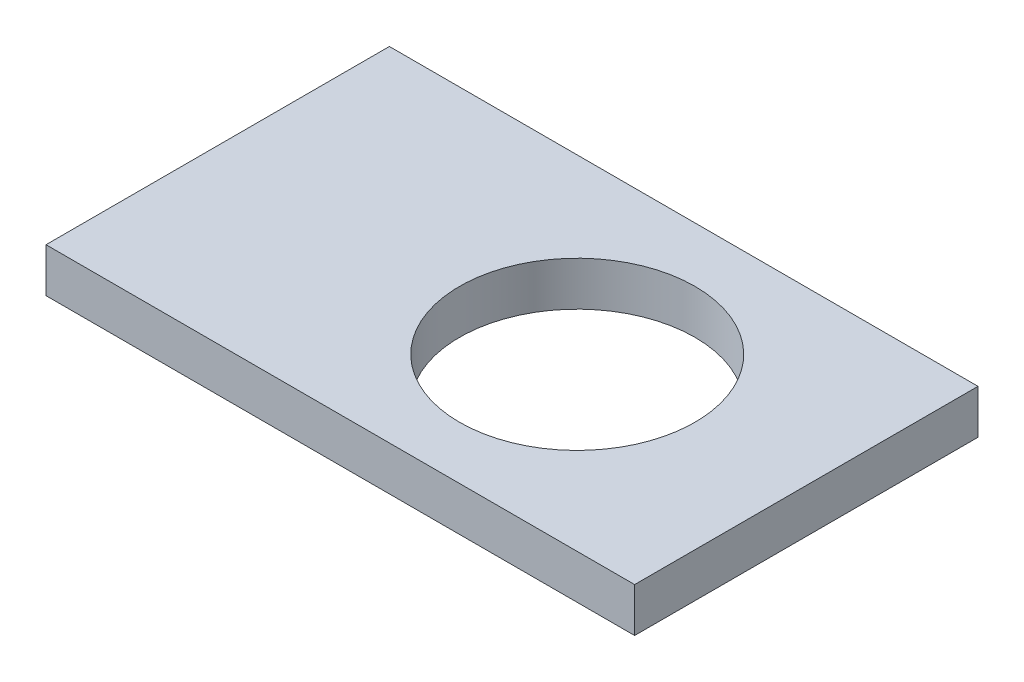
ISO-10303-21;
HEADER;
FILE_DESCRIPTION(('STEP AP214'),'2;1');
FILE_NAME('part.step','',(''),(''),'','','');
FILE_SCHEMA(('AUTOMOTIVE_DESIGN { 1 0 10303 214 1 1 1 1 }'));
ENDSEC;
DATA;
#1=APPLICATION_CONTEXT('core data for automotive mechanical design processes');
#2=APPLICATION_PROTOCOL_DEFINITION('international standard','automotive_design',2000,#1);
#3=PRODUCT_CONTEXT('',#1,'mechanical');
#4=PRODUCT('Part','Part','',(#3));
#5=PRODUCT_RELATED_PRODUCT_CATEGORY('part','',(#4));
#6=PRODUCT_DEFINITION_FORMATION('','',#4);
#7=PRODUCT_DEFINITION_CONTEXT('part definition',#1,'design');
#8=PRODUCT_DEFINITION('design','',#6,#7);
#9=PRODUCT_DEFINITION_SHAPE('','',#8);
#10=(LENGTH_UNIT() NAMED_UNIT(*) SI_UNIT(.MILLI.,.METRE.));
#11=(NAMED_UNIT(*) PLANE_ANGLE_UNIT() SI_UNIT($,.RADIAN.));
#12=(NAMED_UNIT(*) SI_UNIT($,.STERADIAN.) SOLID_ANGLE_UNIT());
#13=UNCERTAINTY_MEASURE_WITH_UNIT(LENGTH_MEASURE(1.E-05),#10,'distance_accuracy_value','');
#14=(GEOMETRIC_REPRESENTATION_CONTEXT(3) GLOBAL_UNCERTAINTY_ASSIGNED_CONTEXT((#13)) GLOBAL_UNIT_ASSIGNED_CONTEXT((#10,
#11,#12)) REPRESENTATION_CONTEXT('',''));
#15=CARTESIAN_POINT('',(0.,0.,0.));
#16=DIRECTION('',(0.,0.,1.));
#17=DIRECTION('',(1.,0.,0.));
#18=AXIS2_PLACEMENT_3D('',#15,#16,#17);
#19=CARTESIAN_POINT('',(-248.225373277609,25.5,203.896384634695));
#20=DIRECTION('',(0.,-1.,0.));
#21=DIRECTION('',(0.,0.,-1.));
#22=AXIS2_PLACEMENT_3D('',#19,#20,#21);
#23=PLANE('',#22);
#24=DIRECTION('',(0.,0.,-1.));
#25=VECTOR('',#24,1.);
#26=CARTESIAN_POINT('',(351.774626722391,25.5,203.896384634695));
#27=LINE('',#26,#25);
#28=CARTESIAN_POINT('',(351.774626722391,25.5,203.896384634695));
#29=VERTEX_POINT('',#28);
#30=CARTESIAN_POINT('',(351.774626722391,25.5,-146.103615365305));
#31=VERTEX_POINT('',#30);
#32=EDGE_CURVE('E86',#29,#31,#27,.T.);
#33=ORIENTED_EDGE('',*,*,#32,.T.);
#34=DIRECTION('',(1.,0.,0.));
#35=VECTOR('',#34,1.);
#36=CARTESIAN_POINT('',(-313.373850881842,25.5,-146.103615365305));
#37=LINE('',#36,#35);
#38=CARTESIAN_POINT('',(-248.225373277609,25.5,-146.103615365305));
#39=VERTEX_POINT('',#38);
#40=EDGE_CURVE('E50',#39,#31,#37,.T.);
#41=ORIENTED_EDGE('',*,*,#40,.F.);
#42=DIRECTION('',(0.,0.,1.));
#43=VECTOR('',#42,1.);
#44=CARTESIAN_POINT('',(-248.225373277609,25.5,203.896384634695));
#45=LINE('',#44,#43);
#46=CARTESIAN_POINT('',(-248.225373277609,25.5,203.896384634695));
#47=VERTEX_POINT('',#46);
#48=EDGE_CURVE('E93',#39,#47,#45,.T.);
#49=ORIENTED_EDGE('',*,*,#48,.T.);
#50=DIRECTION('',(1.,0.,0.));
#51=VECTOR('',#50,1.);
#52=CARTESIAN_POINT('',(-248.225373277609,25.5,203.896384634695));
#53=LINE('',#52,#51);
#54=EDGE_CURVE('E58',#47,#29,#53,.T.);
#55=ORIENTED_EDGE('',*,*,#54,.T.);
#56=EDGE_LOOP('',(#33,#41,#49,#55));
#57=FACE_BOUND('',#56,.T.);
#58=CARTESIAN_POINT('',(119.274626722391,25.5,29.8963846346953));
#59=DIRECTION('',(0.,1.,0.));
#60=DIRECTION('',(0.,0.,1.));
#61=AXIS2_PLACEMENT_3D('',#58,#59,#60);
#62=CIRCLE('',#61,120.);
#63=CARTESIAN_POINT('',(119.274626722391,25.5,149.896384634695));
#64=VERTEX_POINT('',#63);
#65=EDGE_CURVE('E98',#64,#64,#62,.T.);
#66=ORIENTED_EDGE('',*,*,#65,.F.);
#67=EDGE_LOOP('',(#66));
#68=FACE_BOUND('',#67,.T.);
#69=ADVANCED_FACE('F35',(#57,#68),#23,.F.);
#70=CARTESIAN_POINT('',(-248.225373277609,-19.5,203.896384634695));
#71=DIRECTION('',(0.,-1.,0.));
#72=DIRECTION('',(0.,0.,-1.));
#73=AXIS2_PLACEMENT_3D('',#70,#71,#72);
#74=PLANE('',#73);
#75=DIRECTION('',(1.,0.,0.));
#76=VECTOR('',#75,1.);
#77=CARTESIAN_POINT('',(-313.373850881842,-19.5,-146.103615365305));
#78=LINE('',#77,#76);
#79=CARTESIAN_POINT('',(-248.225373277609,-19.5,-146.103615365305));
#80=VERTEX_POINT('',#79);
#81=CARTESIAN_POINT('',(351.774626722391,-19.5,-146.103615365305));
#82=VERTEX_POINT('',#81);
#83=EDGE_CURVE('E92',#80,#82,#78,.T.);
#84=ORIENTED_EDGE('',*,*,#83,.T.);
#85=DIRECTION('',(0.,0.,-1.));
#86=VECTOR('',#85,1.);
#87=CARTESIAN_POINT('',(351.774626722391,-19.5,203.896384634695));
#88=LINE('',#87,#86);
#89=CARTESIAN_POINT('',(351.774626722391,-19.5,203.896384634695));
#90=VERTEX_POINT('',#89);
#91=EDGE_CURVE('E80',#90,#82,#88,.T.);
#92=ORIENTED_EDGE('',*,*,#91,.F.);
#93=DIRECTION('',(1.,0.,0.));
#94=VECTOR('',#93,1.);
#95=CARTESIAN_POINT('',(-248.225373277609,-19.5,203.896384634695));
#96=LINE('',#95,#94);
#97=CARTESIAN_POINT('',(-248.225373277609,-19.5,203.896384634695));
#98=VERTEX_POINT('',#97);
#99=EDGE_CURVE('E71',#98,#90,#96,.T.);
#100=ORIENTED_EDGE('',*,*,#99,.F.);
#101=DIRECTION('',(0.,0.,1.));
#102=VECTOR('',#101,1.);
#103=CARTESIAN_POINT('',(-248.225373277609,-19.5,203.896384634695));
#104=LINE('',#103,#102);
#105=EDGE_CURVE('E81',#80,#98,#104,.T.);
#106=ORIENTED_EDGE('',*,*,#105,.F.);
#107=EDGE_LOOP('',(#84,#92,#100,#106));
#108=FACE_BOUND('',#107,.T.);
#109=CARTESIAN_POINT('',(119.274626722391,-19.5,29.8963846346953));
#110=DIRECTION('',(0.,1.,0.));
#111=DIRECTION('',(0.,0.,1.));
#112=AXIS2_PLACEMENT_3D('',#109,#110,#111);
#113=CIRCLE('',#112,120.);
#114=CARTESIAN_POINT('',(119.274626722391,-19.5,149.896384634695));
#115=VERTEX_POINT('',#114);
#116=EDGE_CURVE('E101',#115,#115,#113,.T.);
#117=ORIENTED_EDGE('',*,*,#116,.T.);
#118=EDGE_LOOP('',(#117));
#119=FACE_BOUND('',#118,.T.);
#120=ADVANCED_FACE('F89',(#108,#119),#74,.T.);
#121=CARTESIAN_POINT('',(-248.225373277609,25.5,203.896384634695));
#122=DIRECTION('',(1.,0.,0.));
#123=DIRECTION('',(0.,0.,-1.));
#124=AXIS2_PLACEMENT_3D('',#121,#122,#123);
#125=PLANE('',#124);
#126=ORIENTED_EDGE('',*,*,#48,.F.);
#127=DIRECTION('',(0.,-1.,0.));
#128=VECTOR('',#127,1.);
#129=CARTESIAN_POINT('',(-248.225373277609,25.5,-146.103615365305));
#130=LINE('',#129,#128);
#131=EDGE_CURVE('E104',#39,#80,#130,.T.);
#132=ORIENTED_EDGE('',*,*,#131,.T.);
#133=ORIENTED_EDGE('',*,*,#105,.T.);
#134=DIRECTION('',(0.,-1.,0.));
#135=VECTOR('',#134,1.);
#136=CARTESIAN_POINT('',(-248.225373277609,25.5,203.896384634695));
#137=LINE('',#136,#135);
#138=EDGE_CURVE('E43',#47,#98,#137,.T.);
#139=ORIENTED_EDGE('',*,*,#138,.F.);
#140=EDGE_LOOP('',(#126,#132,#133,#139));
#141=FACE_BOUND('',#140,.T.);
#142=ADVANCED_FACE('F37',(#141),#125,.F.);
#143=CARTESIAN_POINT('',(-248.225373277609,25.5,203.896384634695));
#144=DIRECTION('',(0.,0.,-1.));
#145=DIRECTION('',(-1.,0.,0.));
#146=AXIS2_PLACEMENT_3D('',#143,#144,#145);
#147=PLANE('',#146);
#148=ORIENTED_EDGE('',*,*,#99,.T.);
#149=DIRECTION('',(0.,-1.,0.));
#150=VECTOR('',#149,1.);
#151=CARTESIAN_POINT('',(351.774626722391,25.5,203.896384634695));
#152=LINE('',#151,#150);
#153=EDGE_CURVE('E74',#29,#90,#152,.T.);
#154=ORIENTED_EDGE('',*,*,#153,.F.);
#155=ORIENTED_EDGE('',*,*,#54,.F.);
#156=ORIENTED_EDGE('',*,*,#138,.T.);
#157=EDGE_LOOP('',(#148,#154,#155,#156));
#158=FACE_BOUND('',#157,.T.);
#159=ADVANCED_FACE('F73',(#158),#147,.F.);
#160=CARTESIAN_POINT('',(351.774626722391,25.5,203.896384634695));
#161=DIRECTION('',(-1.,0.,0.));
#162=DIRECTION('',(0.,0.,1.));
#163=AXIS2_PLACEMENT_3D('',#160,#161,#162);
#164=PLANE('',#163);
#165=ORIENTED_EDGE('',*,*,#91,.T.);
#166=DIRECTION('',(0.,1.,0.));
#167=VECTOR('',#166,1.);
#168=CARTESIAN_POINT('',(351.774626722391,25.5,-146.103615365305));
#169=LINE('',#168,#167);
#170=EDGE_CURVE('E11',#82,#31,#169,.T.);
#171=ORIENTED_EDGE('',*,*,#170,.T.);
#172=ORIENTED_EDGE('',*,*,#32,.F.);
#173=ORIENTED_EDGE('',*,*,#153,.T.);
#174=EDGE_LOOP('',(#165,#171,#172,#173));
#175=FACE_BOUND('',#174,.T.);
#176=ADVANCED_FACE('F85',(#175),#164,.F.);
#177=CARTESIAN_POINT('',(119.274626722391,25.5,29.8963846346953));
#178=DIRECTION('',(0.,-1.,0.));
#179=DIRECTION('',(0.,0.,-1.));
#180=AXIS2_PLACEMENT_3D('',#177,#178,#179);
#181=CYLINDRICAL_SURFACE('',#180,120.);
#182=ORIENTED_EDGE('',*,*,#65,.T.);
#183=EDGE_LOOP('',(#182));
#184=FACE_BOUND('',#183,.T.);
#185=ORIENTED_EDGE('',*,*,#116,.F.);
#186=EDGE_LOOP('',(#185));
#187=FACE_BOUND('',#186,.T.);
#188=ADVANCED_FACE('F122',(#184,#187),#181,.F.);
#189=CARTESIAN_POINT('',(-313.373850881842,-19.5,-146.103615365305));
#190=DIRECTION('',(0.,0.,1.));
#191=DIRECTION('',(1.,0.,0.));
#192=AXIS2_PLACEMENT_3D('',#189,#190,#191);
#193=PLANE('',#192);
#194=ORIENTED_EDGE('',*,*,#40,.T.);
#195=ORIENTED_EDGE('',*,*,#170,.F.);
#196=ORIENTED_EDGE('',*,*,#83,.F.);
#197=ORIENTED_EDGE('',*,*,#131,.F.);
#198=EDGE_LOOP('',(#194,#195,#196,#197));
#199=FACE_BOUND('',#198,.T.);
#200=ADVANCED_FACE('F115',(#199),#193,.F.);
#201=CLOSED_SHELL('',(#69,#120,#142,#159,#176,#188,#200));
#202=MANIFOLD_SOLID_BREP('B2',#201);
#203=ADVANCED_BREP_SHAPE_REPRESENTATION('',(#18,#202),#14);
#204=SHAPE_DEFINITION_REPRESENTATION(#9,#203);
ENDSEC;
END-ISO-10303-21;
